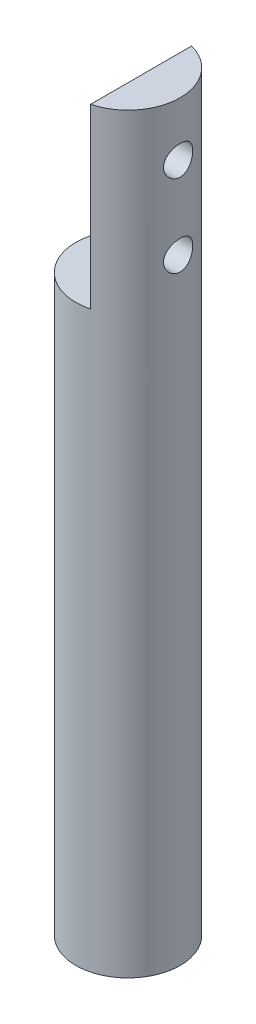
ISO-10303-21;
HEADER;
FILE_DESCRIPTION(('STEP AP214'),'2;1');
FILE_NAME('part.step','',(''),(''),'','','');
FILE_SCHEMA(('AUTOMOTIVE_DESIGN { 1 0 10303 214 1 1 1 1 }'));
ENDSEC;
DATA;
#1=APPLICATION_CONTEXT('core data for automotive mechanical design processes');
#2=APPLICATION_PROTOCOL_DEFINITION('international standard','automotive_design',2000,#1);
#3=PRODUCT_CONTEXT('',#1,'mechanical');
#4=PRODUCT('Part','Part','',(#3));
#5=PRODUCT_RELATED_PRODUCT_CATEGORY('part','',(#4));
#6=PRODUCT_DEFINITION_FORMATION('','',#4);
#7=PRODUCT_DEFINITION_CONTEXT('part definition',#1,'design');
#8=PRODUCT_DEFINITION('design','',#6,#7);
#9=PRODUCT_DEFINITION_SHAPE('','',#8);
#10=(LENGTH_UNIT() NAMED_UNIT(*) SI_UNIT(.MILLI.,.METRE.));
#11=(NAMED_UNIT(*) PLANE_ANGLE_UNIT() SI_UNIT($,.RADIAN.));
#12=(NAMED_UNIT(*) SI_UNIT($,.STERADIAN.) SOLID_ANGLE_UNIT());
#13=UNCERTAINTY_MEASURE_WITH_UNIT(LENGTH_MEASURE(1.E-05),#10,'distance_accuracy_value','');
#14=(GEOMETRIC_REPRESENTATION_CONTEXT(3) GLOBAL_UNCERTAINTY_ASSIGNED_CONTEXT((#13)) GLOBAL_UNIT_ASSIGNED_CONTEXT((#10,
#11,#12)) REPRESENTATION_CONTEXT('',''));
#15=CARTESIAN_POINT('',(0.,0.,0.));
#16=DIRECTION('',(0.,0.,1.));
#17=DIRECTION('',(1.,0.,0.));
#18=AXIS2_PLACEMENT_3D('',#15,#16,#17);
#19=CARTESIAN_POINT('',(0.,57.15,0.));
#20=DIRECTION('',(0.,-1.,0.));
#21=DIRECTION('',(0.,0.,-1.));
#22=AXIS2_PLACEMENT_3D('',#19,#20,#21);
#23=CYLINDRICAL_SURFACE('',#22,3.175);
#24=CARTESIAN_POINT('',(0.,57.15,0.));
#25=DIRECTION('',(0.,1.,0.));
#26=DIRECTION('',(0.,0.,1.));
#27=AXIS2_PLACEMENT_3D('',#24,#25,#26);
#28=CIRCLE('',#27,3.175);
#29=CARTESIAN_POINT('',(0.794,57.15,3.07411597048648));
#30=VERTEX_POINT('',#29);
#31=CARTESIAN_POINT('',(0.794,57.15,-3.07411597048648));
#32=VERTEX_POINT('',#31);
#33=EDGE_CURVE('E72',#30,#32,#28,.T.);
#34=ORIENTED_EDGE('',*,*,#33,.F.);
#35=DIRECTION('',(0.,-1.,0.));
#36=VECTOR('',#35,1.);
#37=CARTESIAN_POINT('',(0.794,57.15,3.07411597048648));
#38=LINE('',#37,#36);
#39=CARTESIAN_POINT('',(0.794,46.355,3.07411597048648));
#40=VERTEX_POINT('',#39);
#41=EDGE_CURVE('E55',#30,#40,#38,.T.);
#42=ORIENTED_EDGE('',*,*,#41,.T.);
#43=CARTESIAN_POINT('',(0.,46.355,0.));
#44=DIRECTION('',(0.,-1.,0.));
#45=DIRECTION('',(0.,0.,-1.));
#46=AXIS2_PLACEMENT_3D('',#43,#44,#45);
#47=CIRCLE('',#46,3.175);
#48=CARTESIAN_POINT('',(0.794,46.355,-3.07411597048648));
#49=VERTEX_POINT('',#48);
#50=EDGE_CURVE('E11',#40,#49,#47,.T.);
#51=ORIENTED_EDGE('',*,*,#50,.T.);
#52=DIRECTION('',(0.,-1.,0.));
#53=VECTOR('',#52,1.);
#54=CARTESIAN_POINT('',(0.794,57.15,-3.07411597048648));
#55=LINE('',#54,#53);
#56=EDGE_CURVE('E66',#49,#32,#55,.F.);
#57=ORIENTED_EDGE('',*,*,#56,.T.);
#58=EDGE_LOOP('',(#34,#42,#51,#57));
#59=FACE_BOUND('',#58,.T.);
#60=CARTESIAN_POINT('',(3.048,48.855,0.889));
#61=CARTESIAN_POINT('',(3.04800074144579,48.9038733654637,0.888999022704976));
#62=CARTESIAN_POINT('',(3.0491883536904,48.9527567364062,0.884956005900081));
#63=CARTESIAN_POINT('',(3.05379446473852,49.0491049848988,0.868925614211581));
#64=CARTESIAN_POINT('',(3.05721393512249,49.096569235257,0.856934779420127));
#65=CARTESIAN_POINT('',(3.06586679255467,49.1886712317961,0.825439260264913));
#66=CARTESIAN_POINT('',(3.07109744934927,49.2333131134177,0.80594588062788));
#67=CARTESIAN_POINT('',(3.08277975485952,49.3187015211283,0.760034756365591));
#68=CARTESIAN_POINT('',(3.0892315334209,49.3594476322734,0.733616275257372));
#69=CARTESIAN_POINT('',(3.10282851808416,49.4370111447716,0.673825649223519));
#70=CARTESIAN_POINT('',(3.10998700385331,49.4737052421073,0.640296533333315));
#71=CARTESIAN_POINT('',(3.12407666925912,49.5410299343499,0.567573542210273));
#72=CARTESIAN_POINT('',(3.13100782316884,49.5716598449399,0.528379028524615));
#73=CARTESIAN_POINT('',(3.14401109305889,49.6265090608122,0.444574237503616));
#74=CARTESIAN_POINT('',(3.15006572408435,49.6506045660182,0.399879985189847));
#75=CARTESIAN_POINT('',(3.16048064645674,49.6908915244846,0.306876342799879));
#76=CARTESIAN_POINT('',(3.16484125401579,49.7070844530113,0.25856762942083));
#77=CARTESIAN_POINT('',(3.17128288506878,49.7307040631926,0.160994613397917));
#78=CARTESIAN_POINT('',(3.17341843142117,49.7383407786606,0.111784817223569));
#79=CARTESIAN_POINT('',(3.17536048694193,49.7452932743306,0.0127392624770652));
#80=CARTESIAN_POINT('',(3.17516742430905,49.7446105843552,-0.0370963793271478));
#81=CARTESIAN_POINT('',(3.17251342098985,49.735088882728,-0.134512605209552));
#82=CARTESIAN_POINT('',(3.17011563326432,49.7264769888744,-0.182117374688842));
#83=CARTESIAN_POINT('',(3.16339697389186,49.7017098300263,-0.275176901920624));
#84=CARTESIAN_POINT('',(3.15907598732543,49.6855541142527,-0.320631531013265));
#85=CARTESIAN_POINT('',(3.14890524255914,49.6459918167282,-0.408664749201556));
#86=CARTESIAN_POINT('',(3.14303970776309,49.6225099164607,-0.451207592285721));
#87=CARTESIAN_POINT('',(3.1304081222126,49.5690202636264,-0.531824617738518));
#88=CARTESIAN_POINT('',(3.12364188079185,49.5390111284853,-0.569897850736415));
#89=CARTESIAN_POINT('',(3.10966917671264,49.472123673229,-0.641850826998317));
#90=CARTESIAN_POINT('',(3.1024555637627,49.4350476993962,-0.675545670788154));
#91=CARTESIAN_POINT('',(3.08860471608588,49.3556980560687,-0.736287397269028));
#92=CARTESIAN_POINT('',(3.0819675243892,49.3134239991019,-0.763333783924003));
#93=CARTESIAN_POINT('',(3.06999005425627,49.2244444097016,-0.810171227980407));
#94=CARTESIAN_POINT('',(3.06465973815351,49.1777083945775,-0.829907105431934));
#95=CARTESIAN_POINT('',(3.05602075215966,49.0813941993218,-0.86117844600627));
#96=CARTESIAN_POINT('',(3.05271152110212,49.0318168122998,-0.872716185537042));
#97=CARTESIAN_POINT('',(3.04861036820764,48.9329684098257,-0.88693469934459));
#98=CARTESIAN_POINT('',(3.04773950623862,48.8837405964397,-0.889893331949965));
#99=CARTESIAN_POINT('',(3.04839680667467,48.7854926125504,-0.887639246904802));
#100=CARTESIAN_POINT('',(3.04992468355344,48.7364724180303,-0.882427501789494));
#101=CARTESIAN_POINT('',(3.0551305705055,48.6411353392666,-0.864226581903411));
#102=CARTESIAN_POINT('',(3.05876110757367,48.5947828515507,-0.851408976918569));
#103=CARTESIAN_POINT('',(3.06771577424975,48.5048869252364,-0.818555399608297));
#104=CARTESIAN_POINT('',(3.07304014129867,48.4613438814956,-0.798518415218363));
#105=CARTESIAN_POINT('',(3.08494108557681,48.3771528913416,-0.751245255343617));
#106=CARTESIAN_POINT('',(3.09154455793357,48.336599053057,-0.723848410491955));
#107=CARTESIAN_POINT('',(3.10519857691837,48.2605624680078,-0.66282910075005));
#108=CARTESIAN_POINT('',(3.11224921630329,48.2250807783703,-0.629205341400975));
#109=CARTESIAN_POINT('',(3.12627846255595,48.1590184791837,-0.555393175540641));
#110=CARTESIAN_POINT('',(3.13324740753382,48.1286329109128,-0.515027982119802));
#111=CARTESIAN_POINT('',(3.14609634169483,48.0750663487539,-0.429610615302621));
#112=CARTESIAN_POINT('',(3.15197638840411,48.0518849742268,-0.384558689701355));
#113=CARTESIAN_POINT('',(3.16194727289417,48.013604157135,-0.291361546194213));
#114=CARTESIAN_POINT('',(3.16605159772319,47.9984435908583,-0.243242948857277));
#115=CARTESIAN_POINT('',(3.17206811720327,47.9764640428509,-0.145007590278837));
#116=CARTESIAN_POINT('',(3.17398085158866,47.969643007273,-0.094891324161075));
#117=CARTESIAN_POINT('',(3.17537031148508,47.9646756462352,0.00410257465857676));
#118=CARTESIAN_POINT('',(3.17492700643421,47.9662445579541,0.0529649880377312));
#119=CARTESIAN_POINT('',(3.17183800207679,47.9773438045136,0.149702046305527));
#120=CARTESIAN_POINT('',(3.1691924010422,47.9868737841116,0.197576735171222));
#121=CARTESIAN_POINT('',(3.16201473209881,48.0134573009097,0.290599820702147));
#122=CARTESIAN_POINT('',(3.15749847230393,48.0304478626725,0.335767515655424));
#123=CARTESIAN_POINT('',(3.14704937045711,48.071414238752,0.422636400107665));
#124=CARTESIAN_POINT('',(3.1411163150138,48.0953911054345,0.464337066141584));
#125=CARTESIAN_POINT('',(3.12825099335539,48.1504535292501,0.544392318898719));
#126=CARTESIAN_POINT('',(3.12129485795685,48.1817240427912,0.582615836411659));
#127=CARTESIAN_POINT('',(3.10725567651361,48.2501422555483,0.653368888845675));
#128=CARTESIAN_POINT('',(3.10017259641915,48.287291553173,0.68589687010055));
#129=CARTESIAN_POINT('',(3.08647631222338,48.3675262150993,0.745143293434857));
#130=CARTESIAN_POINT('',(3.07987922601124,48.4107364855654,0.771696671947967));
#131=CARTESIAN_POINT('',(3.0681400998246,48.5011873096253,0.817126280627679));
#132=CARTESIAN_POINT('',(3.06299720300363,48.5484254684335,0.836007034585142));
#133=CARTESIAN_POINT('',(3.05538486849526,48.638669406351,0.863376907077116));
#134=CARTESIAN_POINT('',(3.05263934900825,48.6813225211211,0.872961556556881));
#135=CARTESIAN_POINT('',(3.0489467122479,48.7676478578347,0.885773084342434));
#136=CARTESIAN_POINT('',(3.04799933734046,48.8113199328759,0.889000873447365));
#137=CARTESIAN_POINT('',(3.048,48.855,0.889));
#138=B_SPLINE_CURVE_WITH_KNOTS('',3,(#60,#61,#62,#63,#64,#65,#66,#67,#68,#69,#70,#71,#72,#73,
#74,#75,#76,#77,#78,#79,#80,#81,#82,#83,#84,#85,#86,#87,#88,#89,#90,#91,#92,#93,#94,#95,#96,#97,
#98,#99,#100,#101,#102,#103,#104,#105,#106,#107,#108,#109,#110,#111,#112,#113,#114,#115,#116,
#117,#118,#119,#120,#121,#122,#123,#124,#125,#126,#127,#128,#129,#130,#131,#132,#133,#134,#135,
#136,#137),.UNSPECIFIED.,.T.,.F.,(4,2,2,2,2,2,2,2,2,2,2,2,2,2,2,2,2,2,2,2,2,2,2,2,2,2,2,2,2,2,2,
2,2,2,2,2,2,2,4),(0.,0.146459287401067,0.292982374544872,0.439285541729908,0.585604274540455,
0.735571650820729,0.885555940626634,1.03820968127062,1.19083491334784,1.33962536162133,
1.48838844982117,1.63301874819052,1.77765769001139,1.923835554253,2.07004441154515,
2.22118784811516,2.37234255795564,2.52461599929671,2.6768471417545,2.82408956362907,
2.97131446029551,3.1153382232534,3.25938218435847,3.40687004300796,3.55438859610561,
3.70666622842306,3.85893581366485,4.01002765448382,4.1610822771287,4.30704320227681,
4.45299761463259,4.59774301104066,4.74251022211431,4.89144959773006,5.04042953893497,
5.19312385990269,5.3457280209917,5.47664325964223,5.60753973963556),.UNSPECIFIED.);
#139=CARTESIAN_POINT('',(3.048,48.855,0.889));
#140=VERTEX_POINT('',#139);
#141=EDGE_CURVE('E94',#140,#140,#138,.T.);
#142=ORIENTED_EDGE('',*,*,#141,.T.);
#143=EDGE_LOOP('',(#142));
#144=FACE_BOUND('',#143,.T.);
#145=CARTESIAN_POINT('',(3.048,53.855,0.889));
#146=CARTESIAN_POINT('',(3.04800074144579,53.9038733654637,0.888999022704975));
#147=CARTESIAN_POINT('',(3.0491883536904,53.9527567364062,0.884956005900081));
#148=CARTESIAN_POINT('',(3.05379446473852,54.0491049848988,0.86892561421158));
#149=CARTESIAN_POINT('',(3.05721393512249,54.096569235257,0.856934779420127));
#150=CARTESIAN_POINT('',(3.06586679255467,54.1886712317961,0.825439260264912));
#151=CARTESIAN_POINT('',(3.07109744934927,54.2333131134177,0.80594588062788));
#152=CARTESIAN_POINT('',(3.08277975485952,54.3187015211283,0.76003475636559));
#153=CARTESIAN_POINT('',(3.0892315334209,54.3594476322734,0.733616275257371));
#154=CARTESIAN_POINT('',(3.10282851808416,54.4370111447716,0.673825649223518));
#155=CARTESIAN_POINT('',(3.10998700385331,54.4737052421074,0.640296533333315));
#156=CARTESIAN_POINT('',(3.12407666925912,54.5410299343499,0.567573542210274));
#157=CARTESIAN_POINT('',(3.13100782316884,54.5716598449399,0.528379028524614));
#158=CARTESIAN_POINT('',(3.14401109305889,54.6265090608122,0.444574237503614));
#159=CARTESIAN_POINT('',(3.15006572408435,54.6506045660182,0.399879985189847));
#160=CARTESIAN_POINT('',(3.16048064645674,54.6908915244847,0.306876342799879));
#161=CARTESIAN_POINT('',(3.16484125401579,54.7070844530113,0.258567629420829));
#162=CARTESIAN_POINT('',(3.17128288506878,54.7307040631926,0.160994613397916));
#163=CARTESIAN_POINT('',(3.17341843142117,54.7383407786606,0.111784817223569));
#164=CARTESIAN_POINT('',(3.17536048694193,54.7452932743307,0.0127392624770647));
#165=CARTESIAN_POINT('',(3.17516742430905,54.7446105843552,-0.0370963793271483));
#166=CARTESIAN_POINT('',(3.17251342098985,54.735088882728,-0.134512605209552));
#167=CARTESIAN_POINT('',(3.17011563326432,54.7264769888744,-0.18211737468884));
#168=CARTESIAN_POINT('',(3.16339697389186,54.7017098300263,-0.275176901920622));
#169=CARTESIAN_POINT('',(3.15907598732543,54.6855541142527,-0.320631531013265));
#170=CARTESIAN_POINT('',(3.14890524255914,54.6459918167282,-0.408664749201556));
#171=CARTESIAN_POINT('',(3.14303970776309,54.6225099164607,-0.451207592285719));
#172=CARTESIAN_POINT('',(3.1304081222126,54.5690202636264,-0.531824617738516));
#173=CARTESIAN_POINT('',(3.12364188079185,54.5390111284853,-0.569897850736414));
#174=CARTESIAN_POINT('',(3.10966917671264,54.472123673229,-0.64185082699832));
#175=CARTESIAN_POINT('',(3.1024555637627,54.4350476993962,-0.675545670788159));
#176=CARTESIAN_POINT('',(3.08860471608588,54.3556980560687,-0.736287397269033));
#177=CARTESIAN_POINT('',(3.0819675243892,54.3134239991019,-0.763333783924004));
#178=CARTESIAN_POINT('',(3.06999005425627,54.2244444097016,-0.810171227980408));
#179=CARTESIAN_POINT('',(3.06465973815351,54.1777083945776,-0.829907105431936));
#180=CARTESIAN_POINT('',(3.05602075215966,54.0813941993218,-0.861178446006272));
#181=CARTESIAN_POINT('',(3.05271152110212,54.0318168122998,-0.872716185537043));
#182=CARTESIAN_POINT('',(3.04861036820764,53.9329684098257,-0.88693469934459));
#183=CARTESIAN_POINT('',(3.04773950623862,53.8837405964397,-0.889893331949965));
#184=CARTESIAN_POINT('',(3.04839680667467,53.7854926125504,-0.887639246904802));
#185=CARTESIAN_POINT('',(3.04992468355344,53.7364724180303,-0.882427501789495));
#186=CARTESIAN_POINT('',(3.0551305705055,53.6411353392666,-0.864226581903412));
#187=CARTESIAN_POINT('',(3.05876110757367,53.5947828515508,-0.851408976918569));
#188=CARTESIAN_POINT('',(3.06771577424975,53.5048869252364,-0.818555399608298));
#189=CARTESIAN_POINT('',(3.07304014129867,53.4613438814956,-0.798518415218364));
#190=CARTESIAN_POINT('',(3.08494108557681,53.3771528913416,-0.751245255343617));
#191=CARTESIAN_POINT('',(3.09154455793357,53.336599053057,-0.723848410491956));
#192=CARTESIAN_POINT('',(3.10519857691837,53.2605624680078,-0.662829100750051));
#193=CARTESIAN_POINT('',(3.11224921630329,53.2250807783703,-0.629205341400976));
#194=CARTESIAN_POINT('',(3.12627846255595,53.1590184791837,-0.555393175540642));
#195=CARTESIAN_POINT('',(3.13324740753382,53.1286329109128,-0.515027982119803));
#196=CARTESIAN_POINT('',(3.14609634169483,53.0750663487539,-0.429610615302622));
#197=CARTESIAN_POINT('',(3.15197638840411,53.0518849742268,-0.384558689701356));
#198=CARTESIAN_POINT('',(3.16194727289417,53.013604157135,-0.291361546194213));
#199=CARTESIAN_POINT('',(3.16605159772319,52.9984435908583,-0.243242948857278));
#200=CARTESIAN_POINT('',(3.17206811720327,52.9764640428509,-0.145007590278837));
#201=CARTESIAN_POINT('',(3.17398085158866,52.969643007273,-0.0948913241610756));
#202=CARTESIAN_POINT('',(3.17537031148508,52.9646756462352,0.00410257465857598));
#203=CARTESIAN_POINT('',(3.17492700643421,52.9662445579541,0.0529649880377303));
#204=CARTESIAN_POINT('',(3.17183800207679,52.9773438045136,0.149702046305526));
#205=CARTESIAN_POINT('',(3.1691924010422,52.9868737841116,0.197576735171222));
#206=CARTESIAN_POINT('',(3.16201473209881,53.0134573009097,0.290599820702145));
#207=CARTESIAN_POINT('',(3.15749847230393,53.0304478626725,0.335767515655421));
#208=CARTESIAN_POINT('',(3.14704937045711,53.071414238752,0.422636400107661));
#209=CARTESIAN_POINT('',(3.1411163150138,53.0953911054345,0.464337066141583));
#210=CARTESIAN_POINT('',(3.12825099335539,53.1504535292501,0.544392318898718));
#211=CARTESIAN_POINT('',(3.12129485795685,53.1817240427912,0.582615836411658));
#212=CARTESIAN_POINT('',(3.10725567651361,53.2501422555483,0.653368888845674));
#213=CARTESIAN_POINT('',(3.10017259641915,53.287291553173,0.68589687010055));
#214=CARTESIAN_POINT('',(3.08647631222338,53.3675262150993,0.745143293434857));
#215=CARTESIAN_POINT('',(3.07987922601124,53.4107364855654,0.771696671947966));
#216=CARTESIAN_POINT('',(3.06814009982461,53.5011873096254,0.817126280627679));
#217=CARTESIAN_POINT('',(3.06299720300363,53.5484254684335,0.836007034585141));
#218=CARTESIAN_POINT('',(3.05538486849526,53.638669406351,0.863376907077115));
#219=CARTESIAN_POINT('',(3.05263934900825,53.6813225211211,0.872961556556881));
#220=CARTESIAN_POINT('',(3.0489467122479,53.7676478578347,0.885773084342433));
#221=CARTESIAN_POINT('',(3.04799933734046,53.8113199328759,0.889000873447365));
#222=CARTESIAN_POINT('',(3.048,53.855,0.889));
#223=B_SPLINE_CURVE_WITH_KNOTS('',3,(#145,#146,#147,#148,#149,#150,#151,#152,#153,#154,#155,
#156,#157,#158,#159,#160,#161,#162,#163,#164,#165,#166,#167,#168,#169,#170,#171,#172,#173,#174,
#175,#176,#177,#178,#179,#180,#181,#182,#183,#184,#185,#186,#187,#188,#189,#190,#191,#192,#193,
#194,#195,#196,#197,#198,#199,#200,#201,#202,#203,#204,#205,#206,#207,#208,#209,#210,#211,#212,
#213,#214,#215,#216,#217,#218,#219,#220,#221,#222),.UNSPECIFIED.,.T.,.F.,(4,2,2,2,2,2,2,2,2,2,2,
2,2,2,2,2,2,2,2,2,2,2,2,2,2,2,2,2,2,2,2,2,2,2,2,2,2,2,4),(0.,0.146459287401067,
0.292982374544872,0.439285541729908,0.585604274540455,0.735571650820734,0.885555940626635,
1.03820968127062,1.19083491334784,1.33962536162133,1.48838844982117,1.63301874819051,
1.77765769001139,1.92383555425299,2.07004441154515,2.22118784811517,2.37234255795564,
2.52461599929672,2.6768471417545,2.82408956362908,2.97131446029551,3.1153382232534,
3.25938218435847,3.40687004300796,3.55438859610561,3.70666622842306,3.85893581366485,
4.01002765448382,4.1610822771287,4.30704320227681,4.45299761463259,4.59774301104066,
4.7425102221143,4.89144959773006,5.04042953893497,5.19312385990269,5.3457280209917,
5.47664325964223,5.60753973963556),.UNSPECIFIED.);
#224=CARTESIAN_POINT('',(3.048,53.855,0.889));
#225=VERTEX_POINT('',#224);
#226=EDGE_CURVE('E86',#225,#225,#223,.T.);
#227=ORIENTED_EDGE('',*,*,#226,.T.);
#228=EDGE_LOOP('',(#227));
#229=FACE_BOUND('',#228,.T.);
#230=CARTESIAN_POINT('',(0.,11.4,0.));
#231=DIRECTION('',(0.,-1.,0.));
#232=DIRECTION('',(0.,0.,-1.));
#233=AXIS2_PLACEMENT_3D('',#230,#231,#232);
#234=CIRCLE('',#233,3.175);
#235=CARTESIAN_POINT('',(0.,11.4,-3.175));
#236=VERTEX_POINT('',#235);
#237=EDGE_CURVE('E42',#236,#236,#234,.T.);
#238=ORIENTED_EDGE('',*,*,#237,.F.);
#239=EDGE_LOOP('',(#238));
#240=FACE_BOUND('',#239,.T.);
#241=ADVANCED_FACE('F38',(#59,#144,#229,#240),#23,.T.);
#242=CARTESIAN_POINT('',(0.,57.15,0.));
#243=DIRECTION('',(0.,1.,0.));
#244=DIRECTION('',(0.,0.,1.));
#245=AXIS2_PLACEMENT_3D('',#242,#243,#244);
#246=PLANE('',#245);
#247=DIRECTION('',(0.,0.,-1.));
#248=VECTOR('',#247,1.);
#249=CARTESIAN_POINT('',(0.794,57.15,0.));
#250=LINE('',#249,#248);
#251=EDGE_CURVE('E48',#30,#32,#250,.T.);
#252=ORIENTED_EDGE('',*,*,#251,.F.);
#253=ORIENTED_EDGE('',*,*,#33,.T.);
#254=EDGE_LOOP('',(#252,#253));
#255=FACE_BOUND('',#254,.T.);
#256=ADVANCED_FACE('F78',(#255),#246,.T.);
#257=CARTESIAN_POINT('',(0.,46.355,0.));
#258=DIRECTION('',(0.,-1.,0.));
#259=DIRECTION('',(0.,0.,-1.));
#260=AXIS2_PLACEMENT_3D('',#257,#258,#259);
#261=PLANE('',#260);
#262=ORIENTED_EDGE('',*,*,#50,.F.);
#263=DIRECTION('',(0.,0.,-1.));
#264=VECTOR('',#263,1.);
#265=CARTESIAN_POINT('',(0.794,46.355,-3.175));
#266=LINE('',#265,#264);
#267=EDGE_CURVE('E76',#40,#49,#266,.T.);
#268=ORIENTED_EDGE('',*,*,#267,.T.);
#269=EDGE_LOOP('',(#262,#268));
#270=FACE_BOUND('',#269,.T.);
#271=ADVANCED_FACE('F111',(#270),#261,.F.);
#272=CARTESIAN_POINT('',(0.794,46.355,-3.175));
#273=DIRECTION('',(1.,0.,0.));
#274=DIRECTION('',(0.,0.,-1.));
#275=AXIS2_PLACEMENT_3D('',#272,#273,#274);
#276=PLANE('',#275);
#277=CARTESIAN_POINT('',(0.794,53.855,0.));
#278=DIRECTION('',(-1.,0.,0.));
#279=DIRECTION('',(0.,0.,1.));
#280=AXIS2_PLACEMENT_3D('',#277,#278,#279);
#281=CIRCLE('',#280,0.888999999999999);
#282=CARTESIAN_POINT('',(0.794,53.855,0.889));
#283=VERTEX_POINT('',#282);
#284=EDGE_CURVE('E170',#283,#283,#281,.T.);
#285=ORIENTED_EDGE('',*,*,#284,.F.);
#286=EDGE_LOOP('',(#285));
#287=FACE_BOUND('',#286,.T.);
#288=CARTESIAN_POINT('',(0.794,48.855,0.));
#289=DIRECTION('',(-1.,0.,0.));
#290=DIRECTION('',(0.,0.,1.));
#291=AXIS2_PLACEMENT_3D('',#288,#289,#290);
#292=CIRCLE('',#291,0.888999999999999);
#293=CARTESIAN_POINT('',(0.794,48.855,0.889));
#294=VERTEX_POINT('',#293);
#295=EDGE_CURVE('E167',#294,#294,#292,.T.);
#296=ORIENTED_EDGE('',*,*,#295,.F.);
#297=EDGE_LOOP('',(#296));
#298=FACE_BOUND('',#297,.T.);
#299=ORIENTED_EDGE('',*,*,#251,.T.);
#300=ORIENTED_EDGE('',*,*,#56,.F.);
#301=ORIENTED_EDGE('',*,*,#267,.F.);
#302=ORIENTED_EDGE('',*,*,#41,.F.);
#303=EDGE_LOOP('',(#299,#300,#301,#302));
#304=FACE_BOUND('',#303,.T.);
#305=ADVANCED_FACE('F65',(#287,#298,#304),#276,.F.);
#306=CARTESIAN_POINT('',(11.589,48.855,0.));
#307=DIRECTION('',(-1.,0.,0.));
#308=DIRECTION('',(0.,0.,1.));
#309=AXIS2_PLACEMENT_3D('',#306,#307,#308);
#310=CYLINDRICAL_SURFACE('',#309,0.888999999999999);
#311=ORIENTED_EDGE('',*,*,#295,.T.);
#312=EDGE_LOOP('',(#311));
#313=FACE_BOUND('',#312,.T.);
#314=ORIENTED_EDGE('',*,*,#141,.F.);
#315=EDGE_LOOP('',(#314));
#316=FACE_BOUND('',#315,.T.);
#317=ADVANCED_FACE('F105',(#313,#316),#310,.F.);
#318=CARTESIAN_POINT('',(11.589,53.855,0.));
#319=DIRECTION('',(-1.,0.,0.));
#320=DIRECTION('',(0.,0.,1.));
#321=AXIS2_PLACEMENT_3D('',#318,#319,#320);
#322=CYLINDRICAL_SURFACE('',#321,0.888999999999999);
#323=ORIENTED_EDGE('',*,*,#284,.T.);
#324=EDGE_LOOP('',(#323));
#325=FACE_BOUND('',#324,.T.);
#326=ORIENTED_EDGE('',*,*,#226,.F.);
#327=EDGE_LOOP('',(#326));
#328=FACE_BOUND('',#327,.T.);
#329=ADVANCED_FACE('F100',(#325,#328),#322,.F.);
#330=CARTESIAN_POINT('',(0.,11.4,0.));
#331=DIRECTION('',(0.,-1.,0.));
#332=DIRECTION('',(0.,0.,-1.));
#333=AXIS2_PLACEMENT_3D('',#330,#331,#332);
#334=PLANE('',#333);
#335=ORIENTED_EDGE('',*,*,#237,.T.);
#336=EDGE_LOOP('',(#335));
#337=FACE_BOUND('',#336,.T.);
#338=ADVANCED_FACE('F104',(#337),#334,.T.);
#339=CLOSED_SHELL('',(#241,#256,#271,#305,#317,#329,#338));
#340=MANIFOLD_SOLID_BREP('B2',#339);
#341=ADVANCED_BREP_SHAPE_REPRESENTATION('',(#18,#340),#14);
#342=SHAPE_DEFINITION_REPRESENTATION(#9,#341);
ENDSEC;
END-ISO-10303-21;
